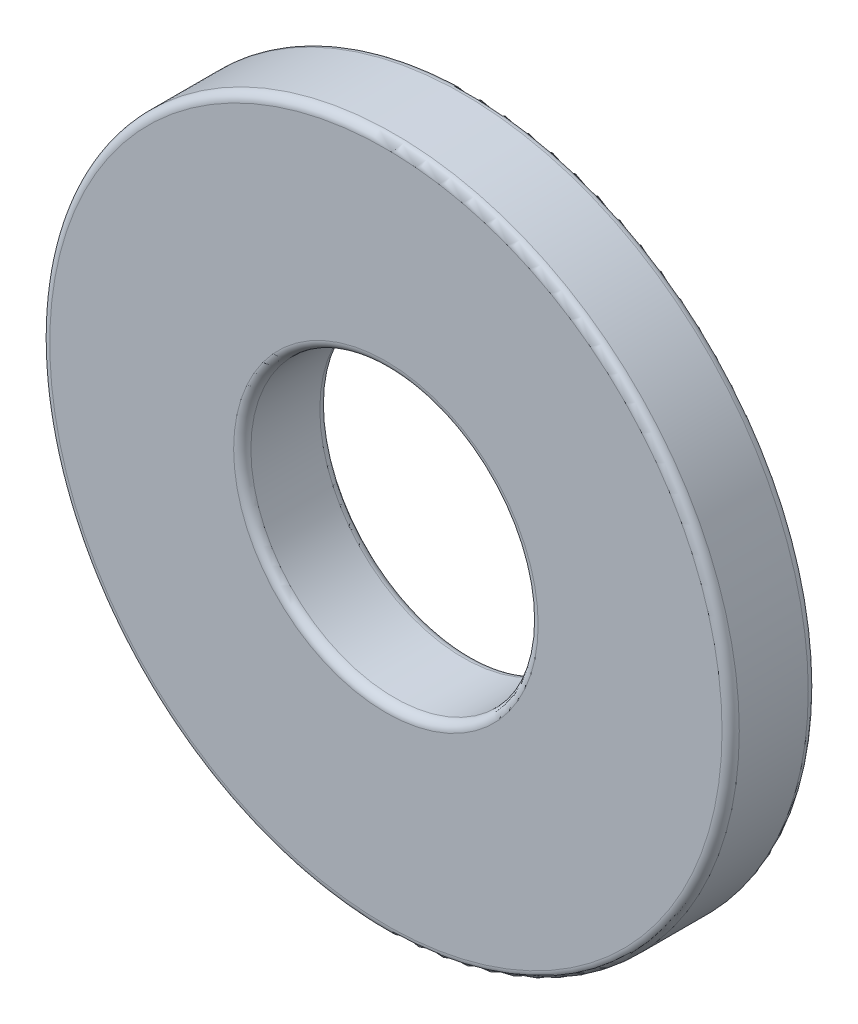
ISO-10303-21;
HEADER;
FILE_DESCRIPTION(('STEP AP214'),'2;1');
FILE_NAME('part.step','',(''),(''),'','','');
FILE_SCHEMA(('AUTOMOTIVE_DESIGN { 1 0 10303 214 1 1 1 1 }'));
ENDSEC;
DATA;
#1=APPLICATION_CONTEXT('core data for automotive mechanical design processes');
#2=APPLICATION_PROTOCOL_DEFINITION('international standard','automotive_design',2000,#1);
#3=PRODUCT_CONTEXT('',#1,'mechanical');
#4=PRODUCT('Part','Part','',(#3));
#5=PRODUCT_RELATED_PRODUCT_CATEGORY('part','',(#4));
#6=PRODUCT_DEFINITION_FORMATION('','',#4);
#7=PRODUCT_DEFINITION_CONTEXT('part definition',#1,'design');
#8=PRODUCT_DEFINITION('design','',#6,#7);
#9=PRODUCT_DEFINITION_SHAPE('','',#8);
#10=(LENGTH_UNIT() NAMED_UNIT(*) SI_UNIT(.MILLI.,.METRE.));
#11=(NAMED_UNIT(*) PLANE_ANGLE_UNIT() SI_UNIT($,.RADIAN.));
#12=(NAMED_UNIT(*) SI_UNIT($,.STERADIAN.) SOLID_ANGLE_UNIT());
#13=UNCERTAINTY_MEASURE_WITH_UNIT(LENGTH_MEASURE(1.E-05),#10,'distance_accuracy_value','');
#14=(GEOMETRIC_REPRESENTATION_CONTEXT(3) GLOBAL_UNCERTAINTY_ASSIGNED_CONTEXT((#13)) GLOBAL_UNIT_ASSIGNED_CONTEXT((#10,
#11,#12)) REPRESENTATION_CONTEXT('',''));
#15=CARTESIAN_POINT('',(0.,0.,0.));
#16=DIRECTION('',(0.,0.,1.));
#17=DIRECTION('',(1.,0.,0.));
#18=AXIS2_PLACEMENT_3D('',#15,#16,#17);
#19=CARTESIAN_POINT('',(0.,0.,1.5));
#20=DIRECTION('',(0.,0.,1.));
#21=DIRECTION('',(1.,0.,0.));
#22=AXIS2_PLACEMENT_3D('',#19,#20,#21);
#23=PLANE('',#22);
#24=CARTESIAN_POINT('',(0.,0.,1.5));
#25=DIRECTION('',(0.,0.,1.));
#26=DIRECTION('',(1.,0.,0.));
#27=AXIS2_PLACEMENT_3D('',#24,#25,#26);
#28=CIRCLE('',#27,2.65);
#29=CARTESIAN_POINT('',(2.65,0.,1.5));
#30=VERTEX_POINT('',#29);
#31=EDGE_CURVE('E10',#30,#30,#28,.F.);
#32=ORIENTED_EDGE('',*,*,#31,.T.);
#33=EDGE_LOOP('',(#32));
#34=FACE_BOUND('',#33,.T.);
#35=CARTESIAN_POINT('',(0.,0.,1.5));
#36=DIRECTION('',(0.,0.,1.));
#37=DIRECTION('',(1.,0.,0.));
#38=AXIS2_PLACEMENT_3D('',#35,#36,#37);
#39=CIRCLE('',#38,5.85);
#40=CARTESIAN_POINT('',(5.85,0.,1.5));
#41=VERTEX_POINT('',#40);
#42=EDGE_CURVE('E38',#41,#41,#39,.T.);
#43=ORIENTED_EDGE('',*,*,#42,.T.);
#44=EDGE_LOOP('',(#43));
#45=FACE_BOUND('',#44,.T.);
#46=ADVANCED_FACE('F31',(#34,#45),#23,.T.);
#47=CARTESIAN_POINT('',(0.,0.,0.));
#48=DIRECTION('',(0.,0.,1.));
#49=DIRECTION('',(1.,0.,0.));
#50=AXIS2_PLACEMENT_3D('',#47,#48,#49);
#51=PLANE('',#50);
#52=CARTESIAN_POINT('',(0.,0.,0.));
#53=DIRECTION('',(0.,0.,1.));
#54=DIRECTION('',(1.,0.,0.));
#55=AXIS2_PLACEMENT_3D('',#52,#53,#54);
#56=CIRCLE('',#55,2.65);
#57=CARTESIAN_POINT('',(2.65,0.,0.));
#58=VERTEX_POINT('',#57);
#59=EDGE_CURVE('E57',#58,#58,#56,.T.);
#60=ORIENTED_EDGE('',*,*,#59,.T.);
#61=EDGE_LOOP('',(#60));
#62=FACE_BOUND('',#61,.T.);
#63=CARTESIAN_POINT('',(0.,0.,0.));
#64=DIRECTION('',(0.,0.,1.));
#65=DIRECTION('',(1.,0.,0.));
#66=AXIS2_PLACEMENT_3D('',#63,#64,#65);
#67=CIRCLE('',#66,5.85);
#68=CARTESIAN_POINT('',(5.85,0.,0.));
#69=VERTEX_POINT('',#68);
#70=EDGE_CURVE('E60',#69,#69,#67,.F.);
#71=ORIENTED_EDGE('',*,*,#70,.T.);
#72=EDGE_LOOP('',(#71));
#73=FACE_BOUND('',#72,.T.);
#74=ADVANCED_FACE('F64',(#62,#73),#51,.F.);
#75=CARTESIAN_POINT('',(0.,0.,1.5));
#76=DIRECTION('',(0.,0.,-1.));
#77=DIRECTION('',(-1.,0.,0.));
#78=AXIS2_PLACEMENT_3D('',#75,#76,#77);
#79=CYLINDRICAL_SURFACE('',#78,6.);
#80=CARTESIAN_POINT('',(0.,0.,0.15));
#81=DIRECTION('',(0.,0.,1.));
#82=DIRECTION('',(1.,0.,0.));
#83=AXIS2_PLACEMENT_3D('',#80,#81,#82);
#84=CIRCLE('',#83,6.);
#85=CARTESIAN_POINT('',(6.,0.,0.15));
#86=VERTEX_POINT('',#85);
#87=EDGE_CURVE('E42',#86,#86,#84,.T.);
#88=ORIENTED_EDGE('',*,*,#87,.T.);
#89=EDGE_LOOP('',(#88));
#90=FACE_BOUND('',#89,.T.);
#91=CARTESIAN_POINT('',(0.,0.,1.35));
#92=DIRECTION('',(0.,0.,1.));
#93=DIRECTION('',(1.,0.,0.));
#94=AXIS2_PLACEMENT_3D('',#91,#92,#93);
#95=CIRCLE('',#94,6.);
#96=CARTESIAN_POINT('',(6.,0.,1.35));
#97=VERTEX_POINT('',#96);
#98=EDGE_CURVE('E46',#97,#97,#95,.F.);
#99=ORIENTED_EDGE('',*,*,#98,.T.);
#100=EDGE_LOOP('',(#99));
#101=FACE_BOUND('',#100,.T.);
#102=ADVANCED_FACE('F74',(#90,#101),#79,.T.);
#103=CARTESIAN_POINT('',(0.,0.,1.5));
#104=DIRECTION('',(0.,0.,-1.));
#105=DIRECTION('',(-1.,0.,0.));
#106=AXIS2_PLACEMENT_3D('',#103,#104,#105);
#107=CYLINDRICAL_SURFACE('',#106,2.5);
#108=CARTESIAN_POINT('',(0.,0.,0.15));
#109=DIRECTION('',(0.,0.,1.));
#110=DIRECTION('',(1.,0.,0.));
#111=AXIS2_PLACEMENT_3D('',#108,#109,#110);
#112=CIRCLE('',#111,2.5);
#113=CARTESIAN_POINT('',(2.5,0.,0.15));
#114=VERTEX_POINT('',#113);
#115=EDGE_CURVE('E51',#114,#114,#112,.F.);
#116=ORIENTED_EDGE('',*,*,#115,.T.);
#117=EDGE_LOOP('',(#116));
#118=FACE_BOUND('',#117,.T.);
#119=CARTESIAN_POINT('',(0.,0.,1.35));
#120=DIRECTION('',(0.,0.,1.));
#121=DIRECTION('',(1.,0.,0.));
#122=AXIS2_PLACEMENT_3D('',#119,#120,#121);
#123=CIRCLE('',#122,2.5);
#124=CARTESIAN_POINT('',(2.5,0.,1.35));
#125=VERTEX_POINT('',#124);
#126=EDGE_CURVE('E54',#125,#125,#123,.T.);
#127=ORIENTED_EDGE('',*,*,#126,.T.);
#128=EDGE_LOOP('',(#127));
#129=FACE_BOUND('',#128,.T.);
#130=ADVANCED_FACE('F77',(#118,#129),#107,.F.);
#131=CARTESIAN_POINT('',(0.,0.,0.15));
#132=DIRECTION('',(0.,0.,1.));
#133=DIRECTION('',(1.,0.,0.));
#134=AXIS2_PLACEMENT_3D('',#131,#132,#133);
#135=TOROIDAL_SURFACE('',#134,2.65,0.15);
#136=ORIENTED_EDGE('',*,*,#115,.F.);
#137=EDGE_LOOP('',(#136));
#138=FACE_BOUND('',#137,.T.);
#139=ORIENTED_EDGE('',*,*,#59,.F.);
#140=EDGE_LOOP('',(#139));
#141=FACE_BOUND('',#140,.T.);
#142=ADVANCED_FACE('F70',(#138,#141),#135,.T.);
#143=CARTESIAN_POINT('',(0.,0.,0.15));
#144=DIRECTION('',(0.,0.,1.));
#145=DIRECTION('',(1.,0.,0.));
#146=AXIS2_PLACEMENT_3D('',#143,#144,#145);
#147=TOROIDAL_SURFACE('',#146,5.85,0.15);
#148=ORIENTED_EDGE('',*,*,#70,.F.);
#149=EDGE_LOOP('',(#148));
#150=FACE_BOUND('',#149,.T.);
#151=ORIENTED_EDGE('',*,*,#87,.F.);
#152=EDGE_LOOP('',(#151));
#153=FACE_BOUND('',#152,.T.);
#154=ADVANCED_FACE('F66',(#150,#153),#147,.T.);
#155=CARTESIAN_POINT('',(0.,0.,1.35));
#156=DIRECTION('',(0.,0.,1.));
#157=DIRECTION('',(1.,0.,0.));
#158=AXIS2_PLACEMENT_3D('',#155,#156,#157);
#159=TOROIDAL_SURFACE('',#158,2.65,0.15);
#160=ORIENTED_EDGE('',*,*,#31,.F.);
#161=EDGE_LOOP('',(#160));
#162=FACE_BOUND('',#161,.T.);
#163=ORIENTED_EDGE('',*,*,#126,.F.);
#164=EDGE_LOOP('',(#163));
#165=FACE_BOUND('',#164,.T.);
#166=ADVANCED_FACE('F69',(#162,#165),#159,.T.);
#167=CARTESIAN_POINT('',(0.,0.,1.35));
#168=DIRECTION('',(0.,0.,1.));
#169=DIRECTION('',(1.,0.,0.));
#170=AXIS2_PLACEMENT_3D('',#167,#168,#169);
#171=TOROIDAL_SURFACE('',#170,5.85,0.15);
#172=ORIENTED_EDGE('',*,*,#98,.F.);
#173=EDGE_LOOP('',(#172));
#174=FACE_BOUND('',#173,.T.);
#175=ORIENTED_EDGE('',*,*,#42,.F.);
#176=EDGE_LOOP('',(#175));
#177=FACE_BOUND('',#176,.T.);
#178=ADVANCED_FACE('F33',(#174,#177),#171,.T.);
#179=CLOSED_SHELL('',(#46,#74,#102,#130,#142,#154,#166,#178));
#180=MANIFOLD_SOLID_BREP('B2',#179);
#181=ADVANCED_BREP_SHAPE_REPRESENTATION('',(#18,#180),#14);
#182=SHAPE_DEFINITION_REPRESENTATION(#9,#181);
ENDSEC;
END-ISO-10303-21;
